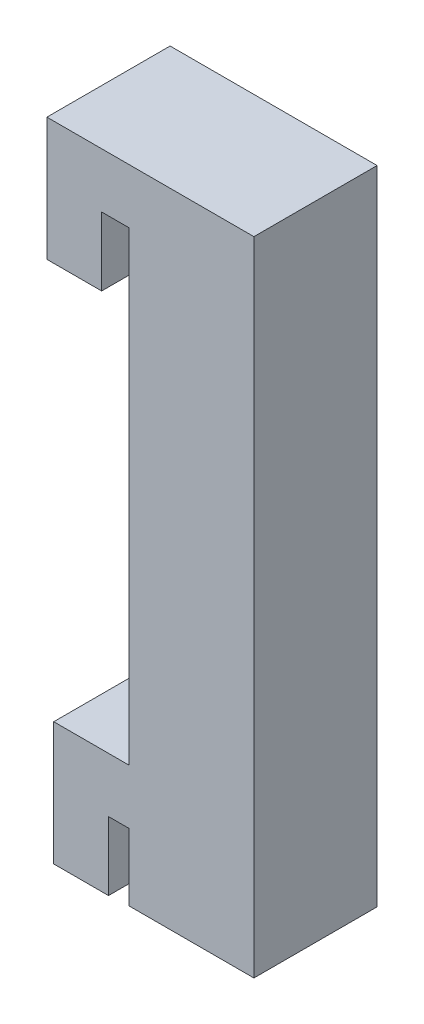
ISO-10303-21;
HEADER;
FILE_DESCRIPTION(('STEP AP214'),'2;1');
FILE_NAME('part.step','',(''),(''),'','','');
FILE_SCHEMA(('AUTOMOTIVE_DESIGN { 1 0 10303 214 1 1 1 1 }'));
ENDSEC;
DATA;
#1=APPLICATION_CONTEXT('core data for automotive mechanical design processes');
#2=APPLICATION_PROTOCOL_DEFINITION('international standard','automotive_design',2000,#1);
#3=PRODUCT_CONTEXT('',#1,'mechanical');
#4=PRODUCT('Part','Part','',(#3));
#5=PRODUCT_RELATED_PRODUCT_CATEGORY('part','',(#4));
#6=PRODUCT_DEFINITION_FORMATION('','',#4);
#7=PRODUCT_DEFINITION_CONTEXT('part definition',#1,'design');
#8=PRODUCT_DEFINITION('design','',#6,#7);
#9=PRODUCT_DEFINITION_SHAPE('','',#8);
#10=(LENGTH_UNIT() NAMED_UNIT(*) SI_UNIT(.MILLI.,.METRE.));
#11=(NAMED_UNIT(*) PLANE_ANGLE_UNIT() SI_UNIT($,.RADIAN.));
#12=(NAMED_UNIT(*) SI_UNIT($,.STERADIAN.) SOLID_ANGLE_UNIT());
#13=UNCERTAINTY_MEASURE_WITH_UNIT(LENGTH_MEASURE(1.E-05),#10,'distance_accuracy_value','');
#14=(GEOMETRIC_REPRESENTATION_CONTEXT(3) GLOBAL_UNCERTAINTY_ASSIGNED_CONTEXT((#13)) GLOBAL_UNIT_ASSIGNED_CONTEXT((#10,
#11,#12)) REPRESENTATION_CONTEXT('',''));
#15=CARTESIAN_POINT('',(0.,0.,0.));
#16=DIRECTION('',(0.,0.,1.));
#17=DIRECTION('',(1.,0.,0.));
#18=AXIS2_PLACEMENT_3D('',#15,#16,#17);
#19=CARTESIAN_POINT('',(0.,0.,9.));
#20=DIRECTION('',(0.,1.,0.));
#21=DIRECTION('',(-1.,0.,0.));
#22=AXIS2_PLACEMENT_3D('',#19,#20,#21);
#23=PLANE('',#22);
#24=DIRECTION('',(1.,0.,0.));
#25=VECTOR('',#24,1.);
#26=CARTESIAN_POINT('',(0.,0.,0.));
#27=LINE('',#26,#25);
#28=CARTESIAN_POINT('',(-4.,0.,0.));
#29=VERTEX_POINT('',#28);
#30=CARTESIAN_POINT('',(0.,0.,0.));
#31=VERTEX_POINT('',#30);
#32=EDGE_CURVE('E167',#29,#31,#27,.T.);
#33=ORIENTED_EDGE('',*,*,#32,.T.);
#34=DIRECTION('',(0.,0.,-1.));
#35=VECTOR('',#34,1.);
#36=CARTESIAN_POINT('',(0.,0.,9.));
#37=LINE('',#36,#35);
#38=CARTESIAN_POINT('',(0.,0.,9.));
#39=VERTEX_POINT('',#38);
#40=EDGE_CURVE('E11',#39,#31,#37,.T.);
#41=ORIENTED_EDGE('',*,*,#40,.F.);
#42=DIRECTION('',(1.,0.,0.));
#43=VECTOR('',#42,1.);
#44=CARTESIAN_POINT('',(0.,0.,9.));
#45=LINE('',#44,#43);
#46=CARTESIAN_POINT('',(-4.,0.,9.));
#47=VERTEX_POINT('',#46);
#48=EDGE_CURVE('E193',#47,#39,#45,.T.);
#49=ORIENTED_EDGE('',*,*,#48,.F.);
#50=DIRECTION('',(0.,0.,-1.));
#51=VECTOR('',#50,1.);
#52=CARTESIAN_POINT('',(-4.,0.,9.));
#53=LINE('',#52,#51);
#54=EDGE_CURVE('E163',#47,#29,#53,.T.);
#55=ORIENTED_EDGE('',*,*,#54,.T.);
#56=EDGE_LOOP('',(#33,#41,#49,#55));
#57=FACE_BOUND('',#56,.T.);
#58=ADVANCED_FACE('F35',(#57),#23,.F.);
#59=CARTESIAN_POINT('',(0.,0.,9.));
#60=DIRECTION('',(-1.,0.,0.));
#61=DIRECTION('',(0.,0.,1.));
#62=AXIS2_PLACEMENT_3D('',#59,#60,#61);
#63=PLANE('',#62);
#64=DIRECTION('',(0.,1.,0.));
#65=VECTOR('',#64,1.);
#66=CARTESIAN_POINT('',(0.,0.,0.));
#67=LINE('',#66,#65);
#68=CARTESIAN_POINT('',(0.,5.,0.));
#69=VERTEX_POINT('',#68);
#70=EDGE_CURVE('E170',#31,#69,#67,.T.);
#71=ORIENTED_EDGE('',*,*,#70,.T.);
#72=DIRECTION('',(0.,0.,-1.));
#73=VECTOR('',#72,1.);
#74=CARTESIAN_POINT('',(0.,5.,9.));
#75=LINE('',#74,#73);
#76=CARTESIAN_POINT('',(0.,5.,9.));
#77=VERTEX_POINT('',#76);
#78=EDGE_CURVE('E43',#77,#69,#75,.T.);
#79=ORIENTED_EDGE('',*,*,#78,.F.);
#80=DIRECTION('',(0.,1.,0.));
#81=VECTOR('',#80,1.);
#82=CARTESIAN_POINT('',(0.,0.,9.));
#83=LINE('',#82,#81);
#84=EDGE_CURVE('E112',#39,#77,#83,.T.);
#85=ORIENTED_EDGE('',*,*,#84,.F.);
#86=ORIENTED_EDGE('',*,*,#40,.T.);
#87=EDGE_LOOP('',(#71,#79,#85,#86));
#88=FACE_BOUND('',#87,.T.);
#89=ADVANCED_FACE('F281',(#88),#63,.F.);
#90=CARTESIAN_POINT('',(0.,5.,9.));
#91=DIRECTION('',(0.,1.,0.));
#92=DIRECTION('',(0.,0.,1.));
#93=AXIS2_PLACEMENT_3D('',#90,#91,#92);
#94=PLANE('',#93);
#95=DIRECTION('',(1.,0.,0.));
#96=VECTOR('',#95,1.);
#97=CARTESIAN_POINT('',(0.,5.,0.));
#98=LINE('',#97,#96);
#99=CARTESIAN_POINT('',(1.5,5.,0.));
#100=VERTEX_POINT('',#99);
#101=EDGE_CURVE('E172',#69,#100,#98,.T.);
#102=ORIENTED_EDGE('',*,*,#101,.T.);
#103=DIRECTION('',(0.,0.,-1.));
#104=VECTOR('',#103,1.);
#105=CARTESIAN_POINT('',(1.5,5.,9.));
#106=LINE('',#105,#104);
#107=CARTESIAN_POINT('',(1.5,5.,9.));
#108=VERTEX_POINT('',#107);
#109=EDGE_CURVE('E218',#108,#100,#106,.T.);
#110=ORIENTED_EDGE('',*,*,#109,.F.);
#111=DIRECTION('',(1.,0.,0.));
#112=VECTOR('',#111,1.);
#113=CARTESIAN_POINT('',(0.,5.,9.));
#114=LINE('',#113,#112);
#115=EDGE_CURVE('E226',#77,#108,#114,.T.);
#116=ORIENTED_EDGE('',*,*,#115,.F.);
#117=ORIENTED_EDGE('',*,*,#78,.T.);
#118=EDGE_LOOP('',(#102,#110,#116,#117));
#119=FACE_BOUND('',#118,.T.);
#120=ADVANCED_FACE('F224',(#119),#94,.F.);
#121=CARTESIAN_POINT('',(1.5,5.,9.));
#122=DIRECTION('',(1.,0.,0.));
#123=DIRECTION('',(0.,1.,0.));
#124=AXIS2_PLACEMENT_3D('',#121,#122,#123);
#125=PLANE('',#124);
#126=DIRECTION('',(0.,-1.,0.));
#127=VECTOR('',#126,1.);
#128=CARTESIAN_POINT('',(1.5,5.,0.));
#129=LINE('',#128,#127);
#130=CARTESIAN_POINT('',(1.5,0.0963894799070883,0.));
#131=VERTEX_POINT('',#130);
#132=EDGE_CURVE('E174',#100,#131,#129,.T.);
#133=ORIENTED_EDGE('',*,*,#132,.T.);
#134=DIRECTION('',(0.,0.,-1.));
#135=VECTOR('',#134,1.);
#136=CARTESIAN_POINT('',(1.5,0.0963894799070883,9.));
#137=LINE('',#136,#135);
#138=CARTESIAN_POINT('',(1.5,0.0963894799070883,9.));
#139=VERTEX_POINT('',#138);
#140=EDGE_CURVE('E215',#139,#131,#137,.T.);
#141=ORIENTED_EDGE('',*,*,#140,.F.);
#142=DIRECTION('',(0.,-1.,0.));
#143=VECTOR('',#142,1.);
#144=CARTESIAN_POINT('',(1.5,5.,9.));
#145=LINE('',#144,#143);
#146=EDGE_CURVE('E244',#108,#139,#145,.T.);
#147=ORIENTED_EDGE('',*,*,#146,.F.);
#148=ORIENTED_EDGE('',*,*,#109,.T.);
#149=EDGE_LOOP('',(#133,#141,#147,#148));
#150=FACE_BOUND('',#149,.T.);
#151=ADVANCED_FACE('F235',(#150),#125,.F.);
#152=CARTESIAN_POINT('',(1.5,0.0963894799070883,9.));
#153=DIRECTION('',(0.,1.,0.));
#154=DIRECTION('',(0.,0.,1.));
#155=AXIS2_PLACEMENT_3D('',#152,#153,#154);
#156=PLANE('',#155);
#157=DIRECTION('',(1.,0.,0.));
#158=VECTOR('',#157,1.);
#159=CARTESIAN_POINT('',(1.5,0.0963894799070883,0.));
#160=LINE('',#159,#158);
#161=CARTESIAN_POINT('',(10.6218736182205,0.0963894799070883,0.));
#162=VERTEX_POINT('',#161);
#163=EDGE_CURVE('E176',#131,#162,#160,.T.);
#164=ORIENTED_EDGE('',*,*,#163,.T.);
#165=DIRECTION('',(0.,0.,-1.));
#166=VECTOR('',#165,1.);
#167=CARTESIAN_POINT('',(10.6218736182205,0.0963894799070883,9.));
#168=LINE('',#167,#166);
#169=CARTESIAN_POINT('',(10.6218736182205,0.0963894799070883,9.));
#170=VERTEX_POINT('',#169);
#171=EDGE_CURVE('E212',#170,#162,#168,.T.);
#172=ORIENTED_EDGE('',*,*,#171,.F.);
#173=DIRECTION('',(1.,0.,0.));
#174=VECTOR('',#173,1.);
#175=CARTESIAN_POINT('',(1.5,0.0963894799070883,9.));
#176=LINE('',#175,#174);
#177=EDGE_CURVE('E241',#139,#170,#176,.T.);
#178=ORIENTED_EDGE('',*,*,#177,.F.);
#179=ORIENTED_EDGE('',*,*,#140,.T.);
#180=EDGE_LOOP('',(#164,#172,#178,#179));
#181=FACE_BOUND('',#180,.T.);
#182=ADVANCED_FACE('F239',(#181),#156,.F.);
#183=CARTESIAN_POINT('',(10.6218736182205,0.0963894799070883,9.));
#184=DIRECTION('',(-1.,0.,0.));
#185=DIRECTION('',(0.,0.,1.));
#186=AXIS2_PLACEMENT_3D('',#183,#184,#185);
#187=PLANE('',#186);
#188=DIRECTION('',(0.,1.,0.));
#189=VECTOR('',#188,1.);
#190=CARTESIAN_POINT('',(10.6218736182205,0.0963894799070883,0.));
#191=LINE('',#190,#189);
#192=CARTESIAN_POINT('',(10.6218736182205,47.,0.));
#193=VERTEX_POINT('',#192);
#194=EDGE_CURVE('E178',#162,#193,#191,.T.);
#195=ORIENTED_EDGE('',*,*,#194,.T.);
#196=DIRECTION('',(0.,0.,-1.));
#197=VECTOR('',#196,1.);
#198=CARTESIAN_POINT('',(10.6218736182205,47.,9.));
#199=LINE('',#198,#197);
#200=CARTESIAN_POINT('',(10.6218736182205,47.,9.));
#201=VERTEX_POINT('',#200);
#202=EDGE_CURVE('E209',#201,#193,#199,.T.);
#203=ORIENTED_EDGE('',*,*,#202,.F.);
#204=DIRECTION('',(0.,1.,0.));
#205=VECTOR('',#204,1.);
#206=CARTESIAN_POINT('',(10.6218736182205,0.0963894799070883,9.));
#207=LINE('',#206,#205);
#208=EDGE_CURVE('E243',#170,#201,#207,.T.);
#209=ORIENTED_EDGE('',*,*,#208,.F.);
#210=ORIENTED_EDGE('',*,*,#171,.T.);
#211=EDGE_LOOP('',(#195,#203,#209,#210));
#212=FACE_BOUND('',#211,.T.);
#213=ADVANCED_FACE('F294',(#212),#187,.F.);
#214=CARTESIAN_POINT('',(10.6218736182205,47.,9.));
#215=DIRECTION('',(0.,-1.,0.));
#216=DIRECTION('',(0.,0.,-1.));
#217=AXIS2_PLACEMENT_3D('',#214,#215,#216);
#218=PLANE('',#217);
#219=DIRECTION('',(-1.,0.,0.));
#220=VECTOR('',#219,1.);
#221=CARTESIAN_POINT('',(10.6218736182205,47.,0.));
#222=LINE('',#221,#220);
#223=CARTESIAN_POINT('',(-4.50000000000001,47.,0.));
#224=VERTEX_POINT('',#223);
#225=EDGE_CURVE('E180',#193,#224,#222,.T.);
#226=ORIENTED_EDGE('',*,*,#225,.T.);
#227=DIRECTION('',(0.,0.,-1.));
#228=VECTOR('',#227,1.);
#229=CARTESIAN_POINT('',(-4.50000000000001,47.,9.));
#230=LINE('',#229,#228);
#231=CARTESIAN_POINT('',(-4.50000000000001,47.,9.));
#232=VERTEX_POINT('',#231);
#233=EDGE_CURVE('E206',#232,#224,#230,.T.);
#234=ORIENTED_EDGE('',*,*,#233,.F.);
#235=DIRECTION('',(-1.,0.,0.));
#236=VECTOR('',#235,1.);
#237=CARTESIAN_POINT('',(10.6218736182205,47.,9.));
#238=LINE('',#237,#236);
#239=EDGE_CURVE('E246',#201,#232,#238,.T.);
#240=ORIENTED_EDGE('',*,*,#239,.F.);
#241=ORIENTED_EDGE('',*,*,#202,.T.);
#242=EDGE_LOOP('',(#226,#234,#240,#241));
#243=FACE_BOUND('',#242,.T.);
#244=ADVANCED_FACE('F297',(#243),#218,.F.);
#245=CARTESIAN_POINT('',(-4.50000000000001,38.,9.));
#246=DIRECTION('',(1.,0.,0.));
#247=DIRECTION('',(0.,1.,0.));
#248=AXIS2_PLACEMENT_3D('',#245,#246,#247);
#249=PLANE('',#248);
#250=DIRECTION('',(0.,-1.,0.));
#251=VECTOR('',#250,1.);
#252=CARTESIAN_POINT('',(-4.50000000000001,38.,0.));
#253=LINE('',#252,#251);
#254=CARTESIAN_POINT('',(-4.50000000000001,38.,0.));
#255=VERTEX_POINT('',#254);
#256=EDGE_CURVE('E182',#224,#255,#253,.T.);
#257=ORIENTED_EDGE('',*,*,#256,.T.);
#258=DIRECTION('',(0.,0.,-1.));
#259=VECTOR('',#258,1.);
#260=CARTESIAN_POINT('',(-4.50000000000001,38.,9.));
#261=LINE('',#260,#259);
#262=CARTESIAN_POINT('',(-4.50000000000001,38.,9.));
#263=VERTEX_POINT('',#262);
#264=EDGE_CURVE('E203',#263,#255,#261,.T.);
#265=ORIENTED_EDGE('',*,*,#264,.F.);
#266=DIRECTION('',(0.,-1.,0.));
#267=VECTOR('',#266,1.);
#268=CARTESIAN_POINT('',(-4.50000000000001,38.,9.));
#269=LINE('',#268,#267);
#270=EDGE_CURVE('E252',#232,#263,#269,.T.);
#271=ORIENTED_EDGE('',*,*,#270,.F.);
#272=ORIENTED_EDGE('',*,*,#233,.T.);
#273=EDGE_LOOP('',(#257,#265,#271,#272));
#274=FACE_BOUND('',#273,.T.);
#275=ADVANCED_FACE('F301',(#274),#249,.F.);
#276=CARTESIAN_POINT('',(-0.500000000000007,38.,9.));
#277=DIRECTION('',(0.,1.,0.));
#278=DIRECTION('',(0.,0.,1.));
#279=AXIS2_PLACEMENT_3D('',#276,#277,#278);
#280=PLANE('',#279);
#281=DIRECTION('',(1.,0.,0.));
#282=VECTOR('',#281,1.);
#283=CARTESIAN_POINT('',(-0.500000000000007,38.,0.));
#284=LINE('',#283,#282);
#285=CARTESIAN_POINT('',(-0.500000000000007,38.,0.));
#286=VERTEX_POINT('',#285);
#287=EDGE_CURVE('E184',#255,#286,#284,.T.);
#288=ORIENTED_EDGE('',*,*,#287,.T.);
#289=DIRECTION('',(0.,0.,-1.));
#290=VECTOR('',#289,1.);
#291=CARTESIAN_POINT('',(-0.500000000000007,38.,9.));
#292=LINE('',#291,#290);
#293=CARTESIAN_POINT('',(-0.500000000000007,38.,9.));
#294=VERTEX_POINT('',#293);
#295=EDGE_CURVE('E200',#294,#286,#292,.T.);
#296=ORIENTED_EDGE('',*,*,#295,.F.);
#297=DIRECTION('',(1.,0.,0.));
#298=VECTOR('',#297,1.);
#299=CARTESIAN_POINT('',(-0.500000000000007,38.,9.));
#300=LINE('',#299,#298);
#301=EDGE_CURVE('E254',#263,#294,#300,.T.);
#302=ORIENTED_EDGE('',*,*,#301,.F.);
#303=ORIENTED_EDGE('',*,*,#264,.T.);
#304=EDGE_LOOP('',(#288,#296,#302,#303));
#305=FACE_BOUND('',#304,.T.);
#306=ADVANCED_FACE('F305',(#305),#280,.F.);
#307=CARTESIAN_POINT('',(-0.500000000000007,43.,9.));
#308=DIRECTION('',(-1.,0.,0.));
#309=DIRECTION('',(0.,-1.,0.));
#310=AXIS2_PLACEMENT_3D('',#307,#308,#309);
#311=PLANE('',#310);
#312=DIRECTION('',(0.,1.,0.));
#313=VECTOR('',#312,1.);
#314=CARTESIAN_POINT('',(-0.500000000000007,43.,0.));
#315=LINE('',#314,#313);
#316=CARTESIAN_POINT('',(-0.500000000000007,43.,0.));
#317=VERTEX_POINT('',#316);
#318=EDGE_CURVE('E186',#286,#317,#315,.T.);
#319=ORIENTED_EDGE('',*,*,#318,.T.);
#320=DIRECTION('',(0.,0.,-1.));
#321=VECTOR('',#320,1.);
#322=CARTESIAN_POINT('',(-0.500000000000007,43.,9.));
#323=LINE('',#322,#321);
#324=CARTESIAN_POINT('',(-0.500000000000007,43.,9.));
#325=VERTEX_POINT('',#324);
#326=EDGE_CURVE('E197',#325,#317,#323,.T.);
#327=ORIENTED_EDGE('',*,*,#326,.F.);
#328=DIRECTION('',(0.,1.,0.));
#329=VECTOR('',#328,1.);
#330=CARTESIAN_POINT('',(-0.500000000000007,43.,9.));
#331=LINE('',#330,#329);
#332=EDGE_CURVE('E256',#294,#325,#331,.T.);
#333=ORIENTED_EDGE('',*,*,#332,.F.);
#334=ORIENTED_EDGE('',*,*,#295,.T.);
#335=EDGE_LOOP('',(#319,#327,#333,#334));
#336=FACE_BOUND('',#335,.T.);
#337=ADVANCED_FACE('F262',(#336),#311,.F.);
#338=CARTESIAN_POINT('',(1.49999999999999,43.,9.));
#339=DIRECTION('',(0.,1.,0.));
#340=DIRECTION('',(0.,0.,1.));
#341=AXIS2_PLACEMENT_3D('',#338,#339,#340);
#342=PLANE('',#341);
#343=DIRECTION('',(1.,0.,0.));
#344=VECTOR('',#343,1.);
#345=CARTESIAN_POINT('',(1.49999999999999,43.,0.));
#346=LINE('',#345,#344);
#347=CARTESIAN_POINT('',(1.49999999999999,43.,0.));
#348=VERTEX_POINT('',#347);
#349=EDGE_CURVE('E188',#317,#348,#346,.T.);
#350=ORIENTED_EDGE('',*,*,#349,.T.);
#351=DIRECTION('',(0.,0.,-1.));
#352=VECTOR('',#351,1.);
#353=CARTESIAN_POINT('',(1.49999999999999,43.,9.));
#354=LINE('',#353,#352);
#355=CARTESIAN_POINT('',(1.49999999999999,43.,9.));
#356=VERTEX_POINT('',#355);
#357=EDGE_CURVE('E158',#356,#348,#354,.T.);
#358=ORIENTED_EDGE('',*,*,#357,.F.);
#359=DIRECTION('',(1.,0.,0.));
#360=VECTOR('',#359,1.);
#361=CARTESIAN_POINT('',(1.49999999999999,43.,9.));
#362=LINE('',#361,#360);
#363=EDGE_CURVE('E149',#325,#356,#362,.T.);
#364=ORIENTED_EDGE('',*,*,#363,.F.);
#365=ORIENTED_EDGE('',*,*,#326,.T.);
#366=EDGE_LOOP('',(#350,#358,#364,#365));
#367=FACE_BOUND('',#366,.T.);
#368=ADVANCED_FACE('F266',(#367),#342,.F.);
#369=CARTESIAN_POINT('',(1.49999999999999,9.,9.));
#370=DIRECTION('',(1.,0.,0.));
#371=DIRECTION('',(0.,0.,-1.));
#372=AXIS2_PLACEMENT_3D('',#369,#370,#371);
#373=PLANE('',#372);
#374=DIRECTION('',(0.,-1.,0.));
#375=VECTOR('',#374,1.);
#376=CARTESIAN_POINT('',(1.49999999999999,9.,0.));
#377=LINE('',#376,#375);
#378=CARTESIAN_POINT('',(1.49999999999999,9.,0.));
#379=VERTEX_POINT('',#378);
#380=EDGE_CURVE('E157',#348,#379,#377,.T.);
#381=ORIENTED_EDGE('',*,*,#380,.T.);
#382=DIRECTION('',(0.,0.,-1.));
#383=VECTOR('',#382,1.);
#384=CARTESIAN_POINT('',(1.49999999999999,9.,9.));
#385=LINE('',#384,#383);
#386=CARTESIAN_POINT('',(1.49999999999999,9.,9.));
#387=VERTEX_POINT('',#386);
#388=EDGE_CURVE('E154',#387,#379,#385,.T.);
#389=ORIENTED_EDGE('',*,*,#388,.F.);
#390=DIRECTION('',(0.,-1.,0.));
#391=VECTOR('',#390,1.);
#392=CARTESIAN_POINT('',(1.49999999999999,9.,9.));
#393=LINE('',#392,#391);
#394=EDGE_CURVE('E143',#356,#387,#393,.T.);
#395=ORIENTED_EDGE('',*,*,#394,.F.);
#396=ORIENTED_EDGE('',*,*,#357,.T.);
#397=EDGE_LOOP('',(#381,#389,#395,#396));
#398=FACE_BOUND('',#397,.T.);
#399=ADVANCED_FACE('F155',(#398),#373,.F.);
#400=CARTESIAN_POINT('',(-4.,9.,9.));
#401=DIRECTION('',(0.,-1.,0.));
#402=DIRECTION('',(0.,0.,-1.));
#403=AXIS2_PLACEMENT_3D('',#400,#401,#402);
#404=PLANE('',#403);
#405=DIRECTION('',(-1.,0.,0.));
#406=VECTOR('',#405,1.);
#407=CARTESIAN_POINT('',(-4.,9.,0.));
#408=LINE('',#407,#406);
#409=CARTESIAN_POINT('',(-4.,9.,0.));
#410=VERTEX_POINT('',#409);
#411=EDGE_CURVE('E98',#379,#410,#408,.T.);
#412=ORIENTED_EDGE('',*,*,#411,.T.);
#413=DIRECTION('',(0.,0.,-1.));
#414=VECTOR('',#413,1.);
#415=CARTESIAN_POINT('',(-4.,9.,9.));
#416=LINE('',#415,#414);
#417=CARTESIAN_POINT('',(-4.,9.,9.));
#418=VERTEX_POINT('',#417);
#419=EDGE_CURVE('E159',#418,#410,#416,.T.);
#420=ORIENTED_EDGE('',*,*,#419,.F.);
#421=DIRECTION('',(-1.,0.,0.));
#422=VECTOR('',#421,1.);
#423=CARTESIAN_POINT('',(-4.,9.,9.));
#424=LINE('',#423,#422);
#425=EDGE_CURVE('E147',#387,#418,#424,.T.);
#426=ORIENTED_EDGE('',*,*,#425,.F.);
#427=ORIENTED_EDGE('',*,*,#388,.T.);
#428=EDGE_LOOP('',(#412,#420,#426,#427));
#429=FACE_BOUND('',#428,.T.);
#430=ADVANCED_FACE('F161',(#429),#404,.F.);
#431=CARTESIAN_POINT('',(-4.,0.,9.));
#432=DIRECTION('',(1.,0.,0.));
#433=DIRECTION('',(0.,0.,-1.));
#434=AXIS2_PLACEMENT_3D('',#431,#432,#433);
#435=PLANE('',#434);
#436=DIRECTION('',(0.,-1.,0.));
#437=VECTOR('',#436,1.);
#438=CARTESIAN_POINT('',(-4.,0.,0.));
#439=LINE('',#438,#437);
#440=EDGE_CURVE('E104',#410,#29,#439,.T.);
#441=ORIENTED_EDGE('',*,*,#440,.T.);
#442=ORIENTED_EDGE('',*,*,#54,.F.);
#443=DIRECTION('',(0.,-1.,0.));
#444=VECTOR('',#443,1.);
#445=CARTESIAN_POINT('',(-4.,0.,9.));
#446=LINE('',#445,#444);
#447=EDGE_CURVE('E51',#418,#47,#446,.T.);
#448=ORIENTED_EDGE('',*,*,#447,.F.);
#449=ORIENTED_EDGE('',*,*,#419,.T.);
#450=EDGE_LOOP('',(#441,#442,#448,#449));
#451=FACE_BOUND('',#450,.T.);
#452=ADVANCED_FACE('F270',(#451),#435,.F.);
#453=CARTESIAN_POINT('',(0.,0.,9.));
#454=DIRECTION('',(0.,0.,-1.));
#455=DIRECTION('',(-1.,0.,0.));
#456=AXIS2_PLACEMENT_3D('',#453,#454,#455);
#457=PLANE('',#456);
#458=ORIENTED_EDGE('',*,*,#48,.T.);
#459=ORIENTED_EDGE('',*,*,#84,.T.);
#460=ORIENTED_EDGE('',*,*,#115,.T.);
#461=ORIENTED_EDGE('',*,*,#146,.T.);
#462=ORIENTED_EDGE('',*,*,#177,.T.);
#463=ORIENTED_EDGE('',*,*,#208,.T.);
#464=ORIENTED_EDGE('',*,*,#239,.T.);
#465=ORIENTED_EDGE('',*,*,#270,.T.);
#466=ORIENTED_EDGE('',*,*,#301,.T.);
#467=ORIENTED_EDGE('',*,*,#332,.T.);
#468=ORIENTED_EDGE('',*,*,#363,.T.);
#469=ORIENTED_EDGE('',*,*,#394,.T.);
#470=ORIENTED_EDGE('',*,*,#425,.T.);
#471=ORIENTED_EDGE('',*,*,#447,.T.);
#472=EDGE_LOOP('',(#458,#459,#460,#461,#462,#463,#464,#465,#466,#467,#468,#469,#470,#471));
#473=FACE_BOUND('',#472,.T.);
#474=ADVANCED_FACE('F145',(#473),#457,.F.);
#475=CARTESIAN_POINT('',(0.,0.,0.));
#476=DIRECTION('',(0.,0.,-1.));
#477=DIRECTION('',(-1.,0.,0.));
#478=AXIS2_PLACEMENT_3D('',#475,#476,#477);
#479=PLANE('',#478);
#480=ORIENTED_EDGE('',*,*,#32,.F.);
#481=ORIENTED_EDGE('',*,*,#440,.F.);
#482=ORIENTED_EDGE('',*,*,#411,.F.);
#483=ORIENTED_EDGE('',*,*,#380,.F.);
#484=ORIENTED_EDGE('',*,*,#349,.F.);
#485=ORIENTED_EDGE('',*,*,#318,.F.);
#486=ORIENTED_EDGE('',*,*,#287,.F.);
#487=ORIENTED_EDGE('',*,*,#256,.F.);
#488=ORIENTED_EDGE('',*,*,#225,.F.);
#489=ORIENTED_EDGE('',*,*,#194,.F.);
#490=ORIENTED_EDGE('',*,*,#163,.F.);
#491=ORIENTED_EDGE('',*,*,#132,.F.);
#492=ORIENTED_EDGE('',*,*,#101,.F.);
#493=ORIENTED_EDGE('',*,*,#70,.F.);
#494=EDGE_LOOP('',(#480,#481,#482,#483,#484,#485,#486,#487,#488,#489,#490,#491,#492,#493));
#495=FACE_BOUND('',#494,.T.);
#496=ADVANCED_FACE('F230',(#495),#479,.T.);
#497=CLOSED_SHELL('',(#58,#89,#120,#151,#182,#213,#244,#275,#306,#337,#368,#399,#430,#452,#474,#496));
#498=MANIFOLD_SOLID_BREP('B2',#497);
#499=ADVANCED_BREP_SHAPE_REPRESENTATION('',(#18,#498),#14);
#500=SHAPE_DEFINITION_REPRESENTATION(#9,#499);
ENDSEC;
END-ISO-10303-21;
